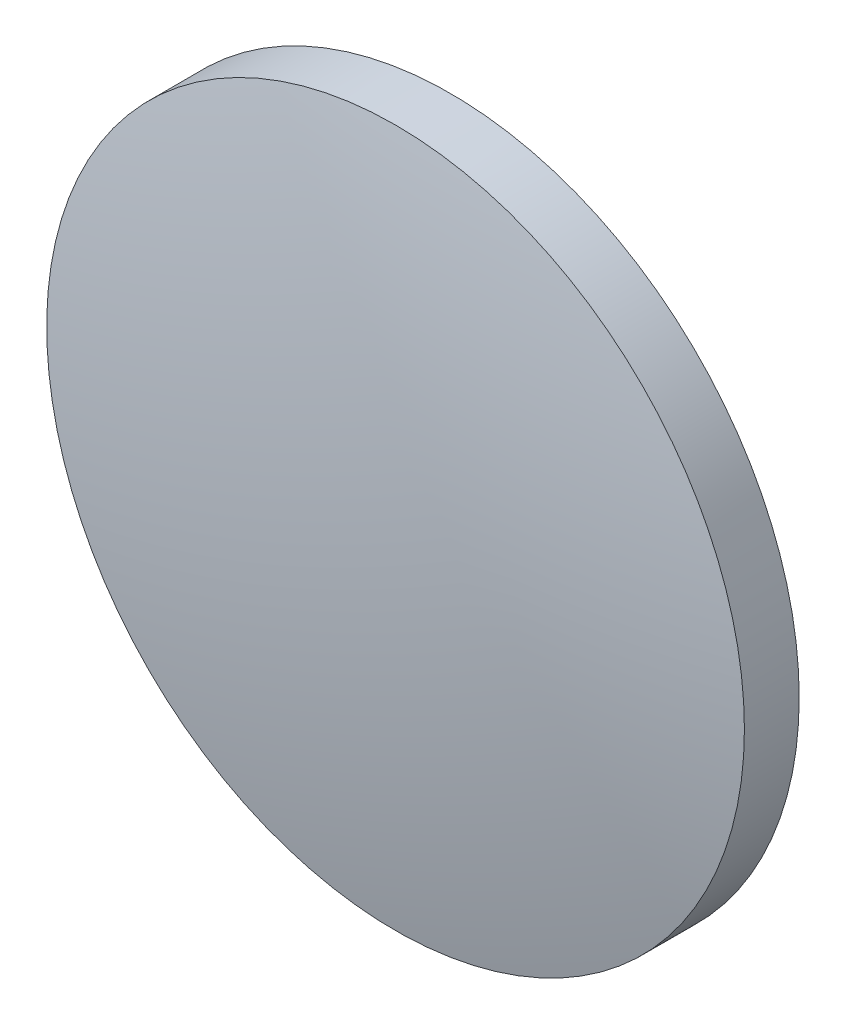
ISO-10303-21;
HEADER;
FILE_DESCRIPTION(('STEP AP214'),'2;1');
FILE_NAME('part.step','',(''),(''),'','','');
FILE_SCHEMA(('AUTOMOTIVE_DESIGN { 1 0 10303 214 1 1 1 1 }'));
ENDSEC;
DATA;
#1=APPLICATION_CONTEXT('core data for automotive mechanical design processes');
#2=APPLICATION_PROTOCOL_DEFINITION('international standard','automotive_design',2000,#1);
#3=PRODUCT_CONTEXT('',#1,'mechanical');
#4=PRODUCT('Part','Part','',(#3));
#5=PRODUCT_RELATED_PRODUCT_CATEGORY('part','',(#4));
#6=PRODUCT_DEFINITION_FORMATION('','',#4);
#7=PRODUCT_DEFINITION_CONTEXT('part definition',#1,'design');
#8=PRODUCT_DEFINITION('design','',#6,#7);
#9=PRODUCT_DEFINITION_SHAPE('','',#8);
#10=(LENGTH_UNIT() NAMED_UNIT(*) SI_UNIT(.MILLI.,.METRE.));
#11=(NAMED_UNIT(*) PLANE_ANGLE_UNIT() SI_UNIT($,.RADIAN.));
#12=(NAMED_UNIT(*) SI_UNIT($,.STERADIAN.) SOLID_ANGLE_UNIT());
#13=UNCERTAINTY_MEASURE_WITH_UNIT(LENGTH_MEASURE(1.E-05),#10,'distance_accuracy_value','');
#14=(GEOMETRIC_REPRESENTATION_CONTEXT(3) GLOBAL_UNCERTAINTY_ASSIGNED_CONTEXT((#13)) GLOBAL_UNIT_ASSIGNED_CONTEXT((#10,
#11,#12)) REPRESENTATION_CONTEXT('',''));
#15=CARTESIAN_POINT('',(0.,0.,0.));
#16=DIRECTION('',(0.,0.,1.));
#17=DIRECTION('',(1.,0.,0.));
#18=AXIS2_PLACEMENT_3D('',#15,#16,#17);
#19=CARTESIAN_POINT('',(0.,0.,-62.75));
#20=DIRECTION('',(0.,0.,1.));
#21=DIRECTION('',(0.,1.,0.));
#22=AXIS2_PLACEMENT_3D('',#19,#20,#21);
#23=SPHERICAL_SURFACE('',#22,64.38);
#24=CARTESIAN_POINT('',(0.,0.,0.364930087896008));
#25=DIRECTION('',(0.,0.,1.));
#26=DIRECTION('',(1.,0.,0.));
#27=AXIS2_PLACEMENT_3D('',#24,#25,#26);
#28=CIRCLE('',#27,12.7);
#29=CARTESIAN_POINT('',(12.7,0.,0.364930087896008));
#30=VERTEX_POINT('',#29);
#31=EDGE_CURVE('E8',#30,#30,#28,.T.);
#32=ORIENTED_EDGE('',*,*,#31,.T.);
#33=EDGE_LOOP('',(#32));
#34=FACE_BOUND('',#33,.T.);
#35=ADVANCED_FACE('F12',(#34),#23,.T.);
#36=CARTESIAN_POINT('',(0.,0.,4.30813204540037));
#37=DIRECTION('',(0.,0.,1.));
#38=DIRECTION('',(1.,0.,0.));
#39=AXIS2_PLACEMENT_3D('',#36,#37,#38);
#40=CYLINDRICAL_SURFACE('',#39,12.7);
#41=ORIENTED_EDGE('',*,*,#31,.F.);
#42=EDGE_LOOP('',(#41));
#43=FACE_BOUND('',#42,.T.);
#44=CARTESIAN_POINT('',(0.,0.,-1.63));
#45=DIRECTION('',(0.,0.,1.));
#46=DIRECTION('',(1.,0.,0.));
#47=AXIS2_PLACEMENT_3D('',#44,#45,#46);
#48=CIRCLE('',#47,12.7);
#49=CARTESIAN_POINT('',(12.7,0.,-1.63));
#50=VERTEX_POINT('',#49);
#51=EDGE_CURVE('E18',#50,#50,#48,.T.);
#52=ORIENTED_EDGE('',*,*,#51,.T.);
#53=EDGE_LOOP('',(#52));
#54=FACE_BOUND('',#53,.T.);
#55=ADVANCED_FACE('F24',(#43,#54),#40,.T.);
#56=CARTESIAN_POINT('',(0.,0.,-1.63));
#57=DIRECTION('',(0.,0.,1.));
#58=DIRECTION('',(1.,0.,0.));
#59=AXIS2_PLACEMENT_3D('',#56,#57,#58);
#60=PLANE('',#59);
#61=ORIENTED_EDGE('',*,*,#51,.F.);
#62=EDGE_LOOP('',(#61));
#63=FACE_BOUND('',#62,.T.);
#64=ADVANCED_FACE('F26',(#63),#60,.F.);
#65=CLOSED_SHELL('',(#35,#55,#64));
#66=MANIFOLD_SOLID_BREP('B1',#65);
#67=ADVANCED_BREP_SHAPE_REPRESENTATION('',(#18,#66),#14);
#68=SHAPE_DEFINITION_REPRESENTATION(#9,#67);
ENDSEC;
END-ISO-10303-21;
